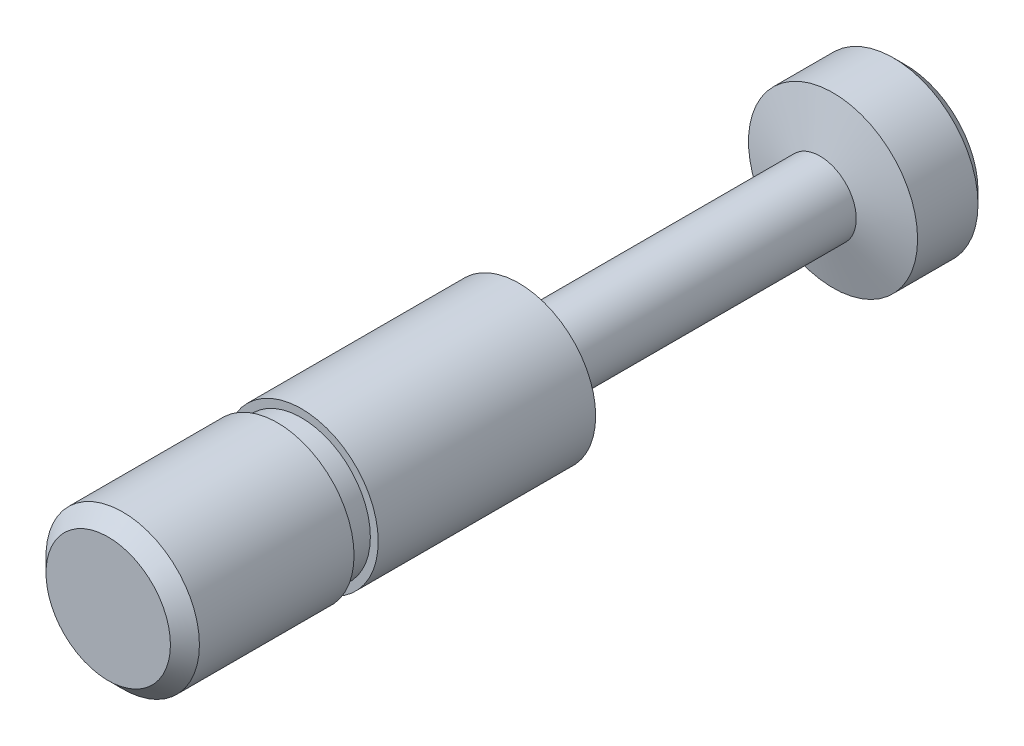
ISO-10303-21;
HEADER;
FILE_DESCRIPTION(('STEP AP214'),'2;1');
FILE_NAME('part.step','',(''),(''),'','','');
FILE_SCHEMA(('AUTOMOTIVE_DESIGN { 1 0 10303 214 1 1 1 1 }'));
ENDSEC;
DATA;
#1=APPLICATION_CONTEXT('core data for automotive mechanical design processes');
#2=APPLICATION_PROTOCOL_DEFINITION('international standard','automotive_design',2000,#1);
#3=PRODUCT_CONTEXT('',#1,'mechanical');
#4=PRODUCT('Part','Part','',(#3));
#5=PRODUCT_RELATED_PRODUCT_CATEGORY('part','',(#4));
#6=PRODUCT_DEFINITION_FORMATION('','',#4);
#7=PRODUCT_DEFINITION_CONTEXT('part definition',#1,'design');
#8=PRODUCT_DEFINITION('design','',#6,#7);
#9=PRODUCT_DEFINITION_SHAPE('','',#8);
#10=(LENGTH_UNIT() NAMED_UNIT(*) SI_UNIT(.MILLI.,.METRE.));
#11=(NAMED_UNIT(*) PLANE_ANGLE_UNIT() SI_UNIT($,.RADIAN.));
#12=(NAMED_UNIT(*) SI_UNIT($,.STERADIAN.) SOLID_ANGLE_UNIT());
#13=UNCERTAINTY_MEASURE_WITH_UNIT(LENGTH_MEASURE(1.E-05),#10,'distance_accuracy_value','');
#14=(GEOMETRIC_REPRESENTATION_CONTEXT(3) GLOBAL_UNCERTAINTY_ASSIGNED_CONTEXT((#13)) GLOBAL_UNIT_ASSIGNED_CONTEXT((#10,
#11,#12)) REPRESENTATION_CONTEXT('',''));
#15=CARTESIAN_POINT('',(0.,0.,0.));
#16=DIRECTION('',(0.,0.,1.));
#17=DIRECTION('',(1.,0.,0.));
#18=AXIS2_PLACEMENT_3D('',#15,#16,#17);
#19=CARTESIAN_POINT('',(0.,0.,-17.97));
#20=DIRECTION('',(0.,0.,1.));
#21=DIRECTION('',(1.,0.,0.));
#22=AXIS2_PLACEMENT_3D('',#19,#20,#21);
#23=CYLINDRICAL_SURFACE('',#22,3.175);
#24=CARTESIAN_POINT('',(0.,0.,-17.));
#25=DIRECTION('',(0.,0.,1.));
#26=DIRECTION('',(1.,0.,0.));
#27=AXIS2_PLACEMENT_3D('',#24,#25,#26);
#28=CIRCLE('',#27,3.175);
#29=CARTESIAN_POINT('',(3.175,0.,-17.));
#30=VERTEX_POINT('',#29);
#31=EDGE_CURVE('E28',#30,#30,#28,.T.);
#32=ORIENTED_EDGE('',*,*,#31,.T.);
#33=EDGE_LOOP('',(#32));
#34=FACE_BOUND('',#33,.T.);
#35=CARTESIAN_POINT('',(0.,0.,-8.));
#36=DIRECTION('',(0.,0.,1.));
#37=DIRECTION('',(1.,0.,0.));
#38=AXIS2_PLACEMENT_3D('',#35,#36,#37);
#39=CIRCLE('',#38,3.175);
#40=CARTESIAN_POINT('',(3.175,0.,-8.));
#41=VERTEX_POINT('',#40);
#42=EDGE_CURVE('E39',#41,#41,#39,.F.);
#43=ORIENTED_EDGE('',*,*,#42,.T.);
#44=EDGE_LOOP('',(#43));
#45=FACE_BOUND('',#44,.T.);
#46=ADVANCED_FACE('F13',(#34,#45),#23,.T.);
#47=CARTESIAN_POINT('',(0.,0.,-8.));
#48=DIRECTION('',(0.,0.,1.));
#49=DIRECTION('',(1.,0.,0.));
#50=AXIS2_PLACEMENT_3D('',#47,#48,#49);
#51=PLANE('',#50);
#52=ORIENTED_EDGE('',*,*,#42,.F.);
#53=EDGE_LOOP('',(#52));
#54=FACE_BOUND('',#53,.T.);
#55=CARTESIAN_POINT('',(0.,0.,-8.));
#56=DIRECTION('',(0.,0.,1.));
#57=DIRECTION('',(1.,0.,0.));
#58=AXIS2_PLACEMENT_3D('',#55,#56,#57);
#59=CIRCLE('',#58,2.85);
#60=CARTESIAN_POINT('',(2.85,0.,-8.));
#61=VERTEX_POINT('',#60);
#62=EDGE_CURVE('E45',#61,#61,#59,.T.);
#63=ORIENTED_EDGE('',*,*,#62,.F.);
#64=EDGE_LOOP('',(#63));
#65=FACE_BOUND('',#64,.T.);
#66=ADVANCED_FACE('F76',(#54,#65),#51,.T.);
#67=CARTESIAN_POINT('',(0.,0.,-7.));
#68=DIRECTION('',(0.,0.,1.));
#69=DIRECTION('',(1.,0.,0.));
#70=AXIS2_PLACEMENT_3D('',#67,#68,#69);
#71=PLANE('',#70);
#72=CARTESIAN_POINT('',(0.,0.,-7.));
#73=DIRECTION('',(0.,0.,1.));
#74=DIRECTION('',(1.,0.,0.));
#75=AXIS2_PLACEMENT_3D('',#72,#73,#74);
#76=CIRCLE('',#75,3.175);
#77=CARTESIAN_POINT('',(3.175,0.,-7.));
#78=VERTEX_POINT('',#77);
#79=EDGE_CURVE('E42',#78,#78,#76,.F.);
#80=ORIENTED_EDGE('',*,*,#79,.T.);
#81=EDGE_LOOP('',(#80));
#82=FACE_BOUND('',#81,.T.);
#83=CARTESIAN_POINT('',(0.,0.,-7.));
#84=DIRECTION('',(0.,0.,1.));
#85=DIRECTION('',(1.,0.,0.));
#86=AXIS2_PLACEMENT_3D('',#83,#84,#85);
#87=CIRCLE('',#86,2.85);
#88=CARTESIAN_POINT('',(2.85,0.,-7.));
#89=VERTEX_POINT('',#88);
#90=EDGE_CURVE('E46',#89,#89,#87,.T.);
#91=ORIENTED_EDGE('',*,*,#90,.T.);
#92=EDGE_LOOP('',(#91));
#93=FACE_BOUND('',#92,.T.);
#94=ADVANCED_FACE('F83',(#82,#93),#71,.F.);
#95=CARTESIAN_POINT('',(0.,0.,-8.));
#96=DIRECTION('',(0.,0.,1.));
#97=DIRECTION('',(1.,0.,0.));
#98=AXIS2_PLACEMENT_3D('',#95,#96,#97);
#99=CYLINDRICAL_SURFACE('',#98,2.85);
#100=ORIENTED_EDGE('',*,*,#62,.T.);
#101=EDGE_LOOP('',(#100));
#102=FACE_BOUND('',#101,.T.);
#103=ORIENTED_EDGE('',*,*,#90,.F.);
#104=EDGE_LOOP('',(#103));
#105=FACE_BOUND('',#104,.T.);
#106=ADVANCED_FACE('F98',(#102,#105),#99,.T.);
#107=CARTESIAN_POINT('',(0.,0.,0.));
#108=DIRECTION('',(0.,0.,1.));
#109=DIRECTION('',(1.,0.,0.));
#110=AXIS2_PLACEMENT_3D('',#107,#108,#109);
#111=PLANE('',#110);
#112=CARTESIAN_POINT('',(0.,0.,0.));
#113=DIRECTION('',(0.,0.,1.));
#114=DIRECTION('',(1.,0.,0.));
#115=AXIS2_PLACEMENT_3D('',#112,#113,#114);
#116=CIRCLE('',#115,2.575);
#117=CARTESIAN_POINT('',(2.575,0.,0.));
#118=VERTEX_POINT('',#117);
#119=EDGE_CURVE('E36',#118,#118,#116,.T.);
#120=ORIENTED_EDGE('',*,*,#119,.T.);
#121=EDGE_LOOP('',(#120));
#122=FACE_BOUND('',#121,.T.);
#123=ADVANCED_FACE('F90',(#122),#111,.T.);
#124=CARTESIAN_POINT('',(0.,0.,-0.6));
#125=DIRECTION('',(0.,0.,1.));
#126=DIRECTION('',(1.,0.,0.));
#127=AXIS2_PLACEMENT_3D('',#124,#125,#126);
#128=CIRCLE('',#127,3.175);
#129=CARTESIAN_POINT('',(3.175,0.,-0.6));
#130=VERTEX_POINT('',#129);
#131=EDGE_CURVE('E33',#130,#130,#128,.F.);
#132=ORIENTED_EDGE('',*,*,#131,.T.);
#133=EDGE_LOOP('',(#132));
#134=FACE_BOUND('',#133,.T.);
#135=ORIENTED_EDGE('',*,*,#79,.F.);
#136=EDGE_LOOP('',(#135));
#137=FACE_BOUND('',#136,.T.);
#138=ADVANCED_FACE('F79',(#134,#137),#23,.T.);
#139=CARTESIAN_POINT('',(0.,0.,-29.46));
#140=DIRECTION('',(0.,0.,1.));
#141=DIRECTION('',(1.,0.,0.));
#142=AXIS2_PLACEMENT_3D('',#139,#140,#141);
#143=CYLINDRICAL_SURFACE('',#142,1.5);
#144=CARTESIAN_POINT('',(0.,0.,-29.46));
#145=DIRECTION('',(0.,0.,1.));
#146=DIRECTION('',(1.,0.,0.));
#147=AXIS2_PLACEMENT_3D('',#144,#145,#146);
#148=CIRCLE('',#147,1.5);
#149=CARTESIAN_POINT('',(1.5,0.,-29.46));
#150=VERTEX_POINT('',#149);
#151=EDGE_CURVE('E49',#150,#150,#148,.T.);
#152=ORIENTED_EDGE('',*,*,#151,.T.);
#153=EDGE_LOOP('',(#152));
#154=FACE_BOUND('',#153,.T.);
#155=CARTESIAN_POINT('',(0.,0.,-17.97));
#156=DIRECTION('',(0.,0.,1.));
#157=DIRECTION('',(1.,0.,0.));
#158=AXIS2_PLACEMENT_3D('',#155,#156,#157);
#159=CIRCLE('',#158,1.5);
#160=CARTESIAN_POINT('',(1.5,0.,-17.97));
#161=VERTEX_POINT('',#160);
#162=EDGE_CURVE('E52',#161,#161,#159,.T.);
#163=ORIENTED_EDGE('',*,*,#162,.F.);
#164=EDGE_LOOP('',(#163));
#165=FACE_BOUND('',#164,.T.);
#166=ADVANCED_FACE('F58',(#154,#165),#143,.T.);
#167=CARTESIAN_POINT('',(0.,0.,-33.));
#168=DIRECTION('',(0.,0.,1.));
#169=DIRECTION('',(1.,0.,0.));
#170=AXIS2_PLACEMENT_3D('',#167,#168,#169);
#171=PLANE('',#170);
#172=CARTESIAN_POINT('',(0.,0.,-33.));
#173=DIRECTION('',(0.,0.,1.));
#174=DIRECTION('',(1.,0.,0.));
#175=AXIS2_PLACEMENT_3D('',#172,#173,#174);
#176=CIRCLE('',#175,3.00000000000001);
#177=CARTESIAN_POINT('',(3.00000000000001,0.,-33.));
#178=VERTEX_POINT('',#177);
#179=EDGE_CURVE('E9',#178,#178,#176,.F.);
#180=ORIENTED_EDGE('',*,*,#179,.T.);
#181=EDGE_LOOP('',(#180));
#182=FACE_BOUND('',#181,.T.);
#183=ADVANCED_FACE('F96',(#182),#171,.F.);
#184=CARTESIAN_POINT('',(0.,0.,-33.));
#185=DIRECTION('',(0.,0.,1.));
#186=DIRECTION('',(1.,0.,0.));
#187=AXIS2_PLACEMENT_3D('',#184,#185,#186);
#188=CYLINDRICAL_SURFACE('',#187,3.5);
#189=CARTESIAN_POINT('',(0.,0.,-32.5));
#190=DIRECTION('',(0.,0.,1.));
#191=DIRECTION('',(1.,0.,0.));
#192=AXIS2_PLACEMENT_3D('',#189,#190,#191);
#193=CIRCLE('',#192,3.5);
#194=CARTESIAN_POINT('',(3.5,0.,-32.5));
#195=VERTEX_POINT('',#194);
#196=EDGE_CURVE('E20',#195,#195,#193,.T.);
#197=ORIENTED_EDGE('',*,*,#196,.T.);
#198=EDGE_LOOP('',(#197));
#199=FACE_BOUND('',#198,.T.);
#200=CARTESIAN_POINT('',(0.,0.,-30.));
#201=DIRECTION('',(0.,0.,1.));
#202=DIRECTION('',(1.,0.,0.));
#203=AXIS2_PLACEMENT_3D('',#200,#201,#202);
#204=CIRCLE('',#203,3.5);
#205=CARTESIAN_POINT('',(3.5,0.,-30.));
#206=VERTEX_POINT('',#205);
#207=EDGE_CURVE('E24',#206,#206,#204,.F.);
#208=ORIENTED_EDGE('',*,*,#207,.T.);
#209=EDGE_LOOP('',(#208));
#210=FACE_BOUND('',#209,.T.);
#211=ADVANCED_FACE('F150',(#199,#210),#188,.T.);
#212=CARTESIAN_POINT('',(0.,0.,0.));
#213=DIRECTION('',(0.,0.,-1.));
#214=DIRECTION('',(-1.,0.,0.));
#215=AXIS2_PLACEMENT_3D('',#212,#213,#214);
#216=CONICAL_SURFACE('',#215,2.575,0.785398163397445);
#217=ORIENTED_EDGE('',*,*,#131,.F.);
#218=EDGE_LOOP('',(#217));
#219=FACE_BOUND('',#218,.T.);
#220=ORIENTED_EDGE('',*,*,#119,.F.);
#221=EDGE_LOOP('',(#220));
#222=FACE_BOUND('',#221,.T.);
#223=ADVANCED_FACE('F71',(#219,#222),#216,.T.);
#224=CARTESIAN_POINT('',(0.,0.,-17.97));
#225=DIRECTION('',(0.,0.,1.));
#226=DIRECTION('',(1.,0.,0.));
#227=AXIS2_PLACEMENT_3D('',#224,#225,#226);
#228=CONICAL_SURFACE('',#227,1.49999999999999,1.04588289424405);
#229=ORIENTED_EDGE('',*,*,#31,.F.);
#230=EDGE_LOOP('',(#229));
#231=FACE_BOUND('',#230,.T.);
#232=ORIENTED_EDGE('',*,*,#162,.T.);
#233=EDGE_LOOP('',(#232));
#234=FACE_BOUND('',#233,.T.);
#235=ADVANCED_FACE('F63',(#231,#234),#228,.T.);
#236=CARTESIAN_POINT('',(0.,0.,-29.46));
#237=DIRECTION('',(0.,0.,-1.));
#238=DIRECTION('',(-1.,0.,0.));
#239=AXIS2_PLACEMENT_3D('',#236,#237,#238);
#240=CONICAL_SURFACE('',#239,1.49999999999996,1.30708449233263);
#241=ORIENTED_EDGE('',*,*,#207,.F.);
#242=EDGE_LOOP('',(#241));
#243=FACE_BOUND('',#242,.T.);
#244=ORIENTED_EDGE('',*,*,#151,.F.);
#245=EDGE_LOOP('',(#244));
#246=FACE_BOUND('',#245,.T.);
#247=ADVANCED_FACE('F61',(#243,#246),#240,.T.);
#248=CARTESIAN_POINT('',(0.,0.,-32.5));
#249=DIRECTION('',(0.,0.,1.));
#250=DIRECTION('',(1.,0.,0.));
#251=AXIS2_PLACEMENT_3D('',#248,#249,#250);
#252=CONICAL_SURFACE('',#251,3.5,0.785398163397443);
#253=ORIENTED_EDGE('',*,*,#179,.F.);
#254=EDGE_LOOP('',(#253));
#255=FACE_BOUND('',#254,.T.);
#256=ORIENTED_EDGE('',*,*,#196,.F.);
#257=EDGE_LOOP('',(#256));
#258=FACE_BOUND('',#257,.T.);
#259=ADVANCED_FACE('F15',(#255,#258),#252,.T.);
#260=CLOSED_SHELL('',(#46,#66,#94,#106,#123,#138,#166,#183,#211,#223,#235,#247,#259));
#261=MANIFOLD_SOLID_BREP('B1',#260);
#262=ADVANCED_BREP_SHAPE_REPRESENTATION('',(#18,#261),#14);
#263=SHAPE_DEFINITION_REPRESENTATION(#9,#262);
ENDSEC;
END-ISO-10303-21;
